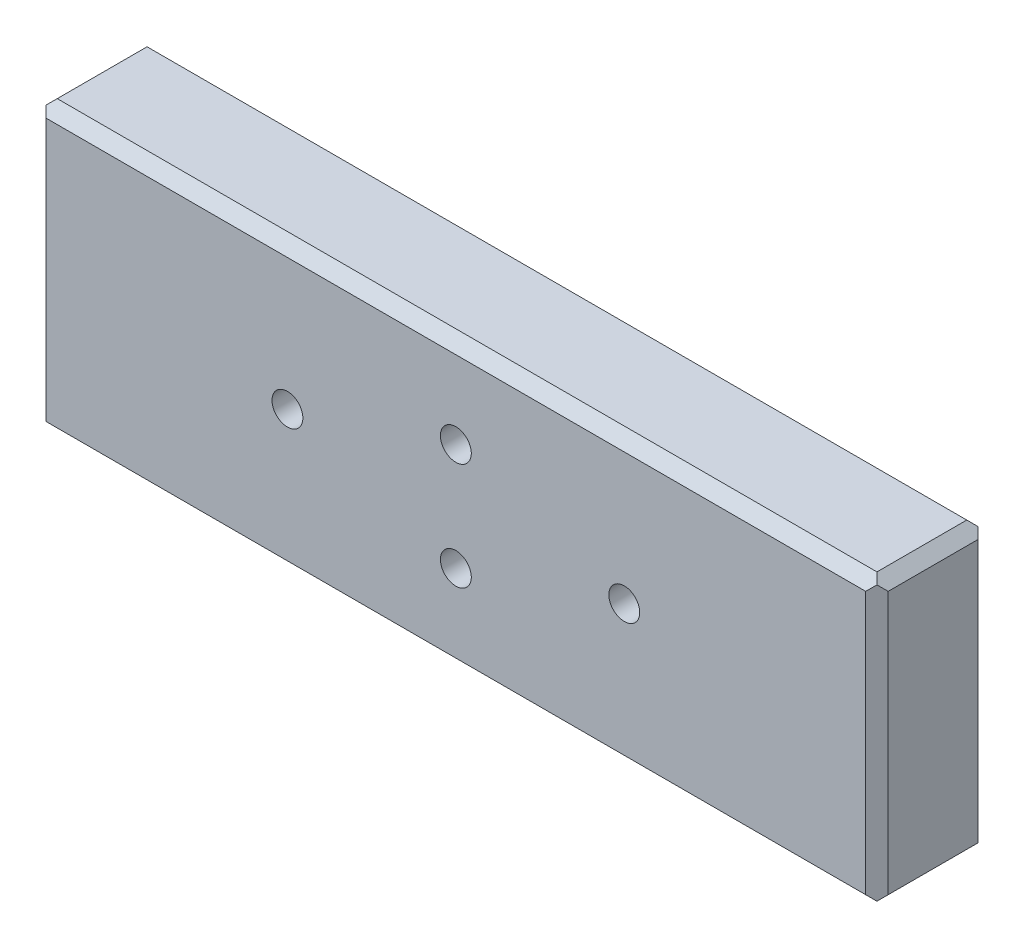
ISO-10303-21;
HEADER;
FILE_DESCRIPTION(('STEP AP214'),'2;1');
FILE_NAME('part.step','',(''),(''),'','','');
FILE_SCHEMA(('AUTOMOTIVE_DESIGN { 1 0 10303 214 1 1 1 1 }'));
ENDSEC;
DATA;
#1=APPLICATION_CONTEXT('core data for automotive mechanical design processes');
#2=APPLICATION_PROTOCOL_DEFINITION('international standard','automotive_design',2000,#1);
#3=PRODUCT_CONTEXT('',#1,'mechanical');
#4=PRODUCT('Part','Part','',(#3));
#5=PRODUCT_RELATED_PRODUCT_CATEGORY('part','',(#4));
#6=PRODUCT_DEFINITION_FORMATION('','',#4);
#7=PRODUCT_DEFINITION_CONTEXT('part definition',#1,'design');
#8=PRODUCT_DEFINITION('design','',#6,#7);
#9=PRODUCT_DEFINITION_SHAPE('','',#8);
#10=(LENGTH_UNIT() NAMED_UNIT(*) SI_UNIT(.MILLI.,.METRE.));
#11=(NAMED_UNIT(*) PLANE_ANGLE_UNIT() SI_UNIT($,.RADIAN.));
#12=(NAMED_UNIT(*) SI_UNIT($,.STERADIAN.) SOLID_ANGLE_UNIT());
#13=UNCERTAINTY_MEASURE_WITH_UNIT(LENGTH_MEASURE(1.E-05),#10,'distance_accuracy_value','');
#14=(GEOMETRIC_REPRESENTATION_CONTEXT(3) GLOBAL_UNCERTAINTY_ASSIGNED_CONTEXT((#13)) GLOBAL_UNIT_ASSIGNED_CONTEXT((#10,
#11,#12)) REPRESENTATION_CONTEXT('',''));
#15=CARTESIAN_POINT('',(0.,0.,0.));
#16=DIRECTION('',(0.,0.,1.));
#17=DIRECTION('',(1.,0.,0.));
#18=AXIS2_PLACEMENT_3D('',#15,#16,#17);
#19=CARTESIAN_POINT('',(0.,-9.55,20.));
#20=DIRECTION('',(0.,0.,-1.));
#21=DIRECTION('',(-1.,0.,0.));
#22=AXIS2_PLACEMENT_3D('',#19,#20,#21);
#23=CYLINDRICAL_SURFACE('',#22,2.75);
#24=CARTESIAN_POINT('',(0.,-9.55,20.));
#25=DIRECTION('',(0.,0.,-1.));
#26=DIRECTION('',(-1.,0.,0.));
#27=AXIS2_PLACEMENT_3D('',#24,#25,#26);
#28=CIRCLE('',#27,2.75);
#29=CARTESIAN_POINT('',(-2.75,-9.55,20.));
#30=VERTEX_POINT('',#29);
#31=EDGE_CURVE('E320',#30,#30,#28,.T.);
#32=ORIENTED_EDGE('',*,*,#31,.F.);
#33=EDGE_LOOP('',(#32));
#34=FACE_BOUND('',#33,.T.);
#35=CARTESIAN_POINT('',(0.,-9.55,5.));
#36=DIRECTION('',(0.,0.,-1.));
#37=DIRECTION('',(-1.,0.,0.));
#38=AXIS2_PLACEMENT_3D('',#35,#36,#37);
#39=CIRCLE('',#38,2.75);
#40=CARTESIAN_POINT('',(-2.75,-9.55,5.));
#41=VERTEX_POINT('',#40);
#42=EDGE_CURVE('E323',#41,#41,#39,.F.);
#43=ORIENTED_EDGE('',*,*,#42,.F.);
#44=EDGE_LOOP('',(#43));
#45=FACE_BOUND('',#44,.T.);
#46=ADVANCED_FACE('F32',(#34,#45),#23,.F.);
#47=CARTESIAN_POINT('',(0.,9.55,20.));
#48=DIRECTION('',(0.,0.,-1.));
#49=DIRECTION('',(-1.,0.,0.));
#50=AXIS2_PLACEMENT_3D('',#47,#48,#49);
#51=CYLINDRICAL_SURFACE('',#50,2.75);
#52=CARTESIAN_POINT('',(0.,9.55,20.));
#53=DIRECTION('',(0.,0.,-1.));
#54=DIRECTION('',(-1.,0.,0.));
#55=AXIS2_PLACEMENT_3D('',#52,#53,#54);
#56=CIRCLE('',#55,2.75);
#57=CARTESIAN_POINT('',(-2.75,9.55,20.));
#58=VERTEX_POINT('',#57);
#59=EDGE_CURVE('E317',#58,#58,#56,.T.);
#60=ORIENTED_EDGE('',*,*,#59,.F.);
#61=EDGE_LOOP('',(#60));
#62=FACE_BOUND('',#61,.T.);
#63=CARTESIAN_POINT('',(0.,9.55,5.));
#64=DIRECTION('',(0.,0.,-1.));
#65=DIRECTION('',(-1.,0.,0.));
#66=AXIS2_PLACEMENT_3D('',#63,#64,#65);
#67=CIRCLE('',#66,2.75);
#68=CARTESIAN_POINT('',(-2.75,9.55,5.));
#69=VERTEX_POINT('',#68);
#70=EDGE_CURVE('E581',#69,#69,#67,.F.);
#71=ORIENTED_EDGE('',*,*,#70,.F.);
#72=EDGE_LOOP('',(#71));
#73=FACE_BOUND('',#72,.T.);
#74=ADVANCED_FACE('F343',(#62,#73),#51,.F.);
#75=CARTESIAN_POINT('',(75.,25.4,20.));
#76=DIRECTION('',(-1.,0.,0.));
#77=DIRECTION('',(0.,0.,1.));
#78=AXIS2_PLACEMENT_3D('',#75,#76,#77);
#79=PLANE('',#78);
#80=DIRECTION('',(0.,1.,0.));
#81=VECTOR('',#80,1.);
#82=CARTESIAN_POINT('',(75.,25.4,2.));
#83=LINE('',#82,#81);
#84=CARTESIAN_POINT('',(75.,-23.4,2.));
#85=VERTEX_POINT('',#84);
#86=CARTESIAN_POINT('',(75.,23.4,2.));
#87=VERTEX_POINT('',#86);
#88=EDGE_CURVE('E178',#85,#87,#83,.T.);
#89=ORIENTED_EDGE('',*,*,#88,.T.);
#90=DIRECTION('',(0.,0.,1.));
#91=VECTOR('',#90,1.);
#92=CARTESIAN_POINT('',(75.,23.4,20.));
#93=LINE('',#92,#91);
#94=CARTESIAN_POINT('',(75.,23.4,18.));
#95=VERTEX_POINT('',#94);
#96=EDGE_CURVE('E240',#87,#95,#93,.T.);
#97=ORIENTED_EDGE('',*,*,#96,.T.);
#98=DIRECTION('',(0.,-1.,0.));
#99=VECTOR('',#98,1.);
#100=CARTESIAN_POINT('',(75.,-25.4,18.));
#101=LINE('',#100,#99);
#102=CARTESIAN_POINT('',(75.,-23.4,18.));
#103=VERTEX_POINT('',#102);
#104=EDGE_CURVE('E209',#95,#103,#101,.T.);
#105=ORIENTED_EDGE('',*,*,#104,.T.);
#106=DIRECTION('',(0.,0.,-1.));
#107=VECTOR('',#106,1.);
#108=CARTESIAN_POINT('',(75.,-23.4,20.));
#109=LINE('',#108,#107);
#110=EDGE_CURVE('E237',#103,#85,#109,.T.);
#111=ORIENTED_EDGE('',*,*,#110,.T.);
#112=EDGE_LOOP('',(#89,#97,#105,#111));
#113=FACE_BOUND('',#112,.T.);
#114=ADVANCED_FACE('F285',(#113),#79,.F.);
#115=CARTESIAN_POINT('',(-75.,25.4,20.));
#116=DIRECTION('',(0.,-1.,0.));
#117=DIRECTION('',(0.,0.,-1.));
#118=AXIS2_PLACEMENT_3D('',#115,#116,#117);
#119=PLANE('',#118);
#120=DIRECTION('',(1.,0.,0.));
#121=VECTOR('',#120,1.);
#122=CARTESIAN_POINT('',(75.,25.4,18.));
#123=LINE('',#122,#121);
#124=CARTESIAN_POINT('',(-73.,25.4,18.));
#125=VERTEX_POINT('',#124);
#126=CARTESIAN_POINT('',(73.,25.4,18.));
#127=VERTEX_POINT('',#126);
#128=EDGE_CURVE('E206',#125,#127,#123,.T.);
#129=ORIENTED_EDGE('',*,*,#128,.T.);
#130=DIRECTION('',(0.,0.,-1.));
#131=VECTOR('',#130,1.);
#132=CARTESIAN_POINT('',(73.,25.4,20.));
#133=LINE('',#132,#131);
#134=CARTESIAN_POINT('',(73.,25.4,2.));
#135=VERTEX_POINT('',#134);
#136=EDGE_CURVE('E226',#127,#135,#133,.T.);
#137=ORIENTED_EDGE('',*,*,#136,.T.);
#138=DIRECTION('',(-1.,0.,0.));
#139=VECTOR('',#138,1.);
#140=CARTESIAN_POINT('',(-75.,25.4,2.));
#141=LINE('',#140,#139);
#142=CARTESIAN_POINT('',(-73.,25.4,2.));
#143=VERTEX_POINT('',#142);
#144=EDGE_CURVE('E185',#135,#143,#141,.T.);
#145=ORIENTED_EDGE('',*,*,#144,.T.);
#146=DIRECTION('',(0.,0.,1.));
#147=VECTOR('',#146,1.);
#148=CARTESIAN_POINT('',(-73.,25.4,20.));
#149=LINE('',#148,#147);
#150=EDGE_CURVE('E215',#143,#125,#149,.T.);
#151=ORIENTED_EDGE('',*,*,#150,.T.);
#152=EDGE_LOOP('',(#129,#137,#145,#151));
#153=FACE_BOUND('',#152,.T.);
#154=ADVANCED_FACE('F302',(#153),#119,.F.);
#155=CARTESIAN_POINT('',(-75.,25.4,20.));
#156=DIRECTION('',(1.,0.,0.));
#157=DIRECTION('',(0.,0.,-1.));
#158=AXIS2_PLACEMENT_3D('',#155,#156,#157);
#159=PLANE('',#158);
#160=DIRECTION('',(0.,1.,0.));
#161=VECTOR('',#160,1.);
#162=CARTESIAN_POINT('',(-75.,25.4,18.));
#163=LINE('',#162,#161);
#164=CARTESIAN_POINT('',(-75.,-23.4,18.));
#165=VERTEX_POINT('',#164);
#166=CARTESIAN_POINT('',(-75.,23.4,18.));
#167=VERTEX_POINT('',#166);
#168=EDGE_CURVE('E203',#165,#167,#163,.T.);
#169=ORIENTED_EDGE('',*,*,#168,.T.);
#170=DIRECTION('',(0.,0.,-1.));
#171=VECTOR('',#170,1.);
#172=CARTESIAN_POINT('',(-75.,23.4,20.));
#173=LINE('',#172,#171);
#174=CARTESIAN_POINT('',(-75.,23.4,2.));
#175=VERTEX_POINT('',#174);
#176=EDGE_CURVE('E252',#167,#175,#173,.T.);
#177=ORIENTED_EDGE('',*,*,#176,.T.);
#178=DIRECTION('',(0.,-1.,0.));
#179=VECTOR('',#178,1.);
#180=CARTESIAN_POINT('',(-75.,25.4,2.));
#181=LINE('',#180,#179);
#182=CARTESIAN_POINT('',(-75.,-23.4,2.));
#183=VERTEX_POINT('',#182);
#184=EDGE_CURVE('E170',#175,#183,#181,.T.);
#185=ORIENTED_EDGE('',*,*,#184,.T.);
#186=DIRECTION('',(0.,0.,1.));
#187=VECTOR('',#186,1.);
#188=CARTESIAN_POINT('',(-75.,-23.4,20.));
#189=LINE('',#188,#187);
#190=EDGE_CURVE('E250',#183,#165,#189,.T.);
#191=ORIENTED_EDGE('',*,*,#190,.T.);
#192=EDGE_LOOP('',(#169,#177,#185,#191));
#193=FACE_BOUND('',#192,.T.);
#194=ADVANCED_FACE('F315',(#193),#159,.F.);
#195=CARTESIAN_POINT('',(-75.,-25.4,20.));
#196=DIRECTION('',(0.,1.,0.));
#197=DIRECTION('',(0.,0.,1.));
#198=AXIS2_PLACEMENT_3D('',#195,#196,#197);
#199=PLANE('',#198);
#200=DIRECTION('',(-1.,0.,0.));
#201=VECTOR('',#200,1.);
#202=CARTESIAN_POINT('',(-75.,-25.4,18.));
#203=LINE('',#202,#201);
#204=CARTESIAN_POINT('',(73.,-25.4,18.));
#205=VERTEX_POINT('',#204);
#206=CARTESIAN_POINT('',(-73.,-25.4,18.));
#207=VERTEX_POINT('',#206);
#208=EDGE_CURVE('E212',#205,#207,#203,.T.);
#209=ORIENTED_EDGE('',*,*,#208,.T.);
#210=DIRECTION('',(0.,0.,-1.));
#211=VECTOR('',#210,1.);
#212=CARTESIAN_POINT('',(-73.,-25.4,20.));
#213=LINE('',#212,#211);
#214=CARTESIAN_POINT('',(-73.,-25.4,2.));
#215=VERTEX_POINT('',#214);
#216=EDGE_CURVE('E264',#207,#215,#213,.T.);
#217=ORIENTED_EDGE('',*,*,#216,.T.);
#218=DIRECTION('',(1.,0.,0.));
#219=VECTOR('',#218,1.);
#220=CARTESIAN_POINT('',(-75.,-25.4,2.));
#221=LINE('',#220,#219);
#222=CARTESIAN_POINT('',(73.,-25.4,2.));
#223=VERTEX_POINT('',#222);
#224=EDGE_CURVE('E176',#215,#223,#221,.T.);
#225=ORIENTED_EDGE('',*,*,#224,.T.);
#226=DIRECTION('',(0.,0.,1.));
#227=VECTOR('',#226,1.);
#228=CARTESIAN_POINT('',(73.,-25.4,20.));
#229=LINE('',#228,#227);
#230=EDGE_CURVE('E262',#223,#205,#229,.T.);
#231=ORIENTED_EDGE('',*,*,#230,.T.);
#232=EDGE_LOOP('',(#209,#217,#225,#231));
#233=FACE_BOUND('',#232,.T.);
#234=ADVANCED_FACE('F330',(#233),#199,.F.);
#235=CARTESIAN_POINT('',(0.,0.,20.));
#236=DIRECTION('',(0.,0.,1.));
#237=DIRECTION('',(1.,0.,0.));
#238=AXIS2_PLACEMENT_3D('',#235,#236,#237);
#239=PLANE('',#238);
#240=DIRECTION('',(-1.,0.,0.));
#241=VECTOR('',#240,1.);
#242=CARTESIAN_POINT('',(-75.,23.4,20.));
#243=LINE('',#242,#241);
#244=CARTESIAN_POINT('',(73.,23.4,20.));
#245=VERTEX_POINT('',#244);
#246=CARTESIAN_POINT('',(-73.,23.4,20.));
#247=VERTEX_POINT('',#246);
#248=EDGE_CURVE('E198',#245,#247,#243,.T.);
#249=ORIENTED_EDGE('',*,*,#248,.T.);
#250=DIRECTION('',(0.,-1.,0.));
#251=VECTOR('',#250,1.);
#252=CARTESIAN_POINT('',(-73.,-25.4,20.));
#253=LINE('',#252,#251);
#254=CARTESIAN_POINT('',(-73.,-23.4,20.));
#255=VERTEX_POINT('',#254);
#256=EDGE_CURVE('E200',#247,#255,#253,.T.);
#257=ORIENTED_EDGE('',*,*,#256,.T.);
#258=DIRECTION('',(1.,0.,0.));
#259=VECTOR('',#258,1.);
#260=CARTESIAN_POINT('',(75.,-23.4,20.));
#261=LINE('',#260,#259);
#262=CARTESIAN_POINT('',(73.,-23.4,20.));
#263=VERTEX_POINT('',#262);
#264=EDGE_CURVE('E188',#255,#263,#261,.T.);
#265=ORIENTED_EDGE('',*,*,#264,.T.);
#266=DIRECTION('',(0.,1.,0.));
#267=VECTOR('',#266,1.);
#268=CARTESIAN_POINT('',(73.,25.4,20.));
#269=LINE('',#268,#267);
#270=EDGE_CURVE('E196',#263,#245,#269,.T.);
#271=ORIENTED_EDGE('',*,*,#270,.T.);
#272=EDGE_LOOP('',(#249,#257,#265,#271));
#273=FACE_BOUND('',#272,.T.);
#274=ORIENTED_EDGE('',*,*,#59,.T.);
#275=EDGE_LOOP('',(#274));
#276=FACE_BOUND('',#275,.T.);
#277=ORIENTED_EDGE('',*,*,#31,.T.);
#278=EDGE_LOOP('',(#277));
#279=FACE_BOUND('',#278,.T.);
#280=CARTESIAN_POINT('',(-30.,0.,20.));
#281=DIRECTION('',(0.,0.,-1.));
#282=DIRECTION('',(-1.,0.,0.));
#283=AXIS2_PLACEMENT_3D('',#280,#281,#282);
#284=CIRCLE('',#283,2.75);
#285=CARTESIAN_POINT('',(-32.75,0.,20.));
#286=VERTEX_POINT('',#285);
#287=EDGE_CURVE('E570',#286,#286,#284,.T.);
#288=ORIENTED_EDGE('',*,*,#287,.T.);
#289=EDGE_LOOP('',(#288));
#290=FACE_BOUND('',#289,.T.);
#291=CARTESIAN_POINT('',(30.,0.,20.));
#292=DIRECTION('',(0.,0.,-1.));
#293=DIRECTION('',(-1.,0.,0.));
#294=AXIS2_PLACEMENT_3D('',#291,#292,#293);
#295=CIRCLE('',#294,2.75);
#296=CARTESIAN_POINT('',(27.25,0.,20.));
#297=VERTEX_POINT('',#296);
#298=EDGE_CURVE('E576',#297,#297,#295,.T.);
#299=ORIENTED_EDGE('',*,*,#298,.T.);
#300=EDGE_LOOP('',(#299));
#301=FACE_BOUND('',#300,.T.);
#302=ADVANCED_FACE('F332',(#273,#276,#279,#290,#301),#239,.T.);
#303=CARTESIAN_POINT('',(0.,0.,0.));
#304=DIRECTION('',(0.,0.,1.));
#305=DIRECTION('',(1.,0.,0.));
#306=AXIS2_PLACEMENT_3D('',#303,#304,#305);
#307=PLANE('',#306);
#308=DIRECTION('',(-1.,0.,0.));
#309=VECTOR('',#308,1.);
#310=CARTESIAN_POINT('',(0.,-23.4,0.));
#311=LINE('',#310,#309);
#312=CARTESIAN_POINT('',(73.,-23.4,0.));
#313=VERTEX_POINT('',#312);
#314=CARTESIAN_POINT('',(-73.,-23.4,0.));
#315=VERTEX_POINT('',#314);
#316=EDGE_CURVE('E175',#313,#315,#311,.T.);
#317=ORIENTED_EDGE('',*,*,#316,.T.);
#318=DIRECTION('',(0.,1.,0.));
#319=VECTOR('',#318,1.);
#320=CARTESIAN_POINT('',(-73.,0.,0.));
#321=LINE('',#320,#319);
#322=CARTESIAN_POINT('',(-73.,23.4,0.));
#323=VERTEX_POINT('',#322);
#324=EDGE_CURVE('E153',#315,#323,#321,.T.);
#325=ORIENTED_EDGE('',*,*,#324,.T.);
#326=DIRECTION('',(1.,0.,0.));
#327=VECTOR('',#326,1.);
#328=CARTESIAN_POINT('',(0.,23.4,0.));
#329=LINE('',#328,#327);
#330=CARTESIAN_POINT('',(73.,23.4,0.));
#331=VERTEX_POINT('',#330);
#332=EDGE_CURVE('E162',#323,#331,#329,.T.);
#333=ORIENTED_EDGE('',*,*,#332,.T.);
#334=DIRECTION('',(0.,-1.,0.));
#335=VECTOR('',#334,1.);
#336=CARTESIAN_POINT('',(73.,0.,0.));
#337=LINE('',#336,#335);
#338=EDGE_CURVE('E169',#331,#313,#337,.T.);
#339=ORIENTED_EDGE('',*,*,#338,.T.);
#340=EDGE_LOOP('',(#317,#325,#333,#339));
#341=FACE_BOUND('',#340,.T.);
#342=CARTESIAN_POINT('',(0.,9.55,0.));
#343=DIRECTION('',(0.,0.,-1.));
#344=DIRECTION('',(-1.,0.,0.));
#345=AXIS2_PLACEMENT_3D('',#342,#343,#344);
#346=CIRCLE('',#345,5.);
#347=CARTESIAN_POINT('',(-5.,9.55,0.));
#348=VERTEX_POINT('',#347);
#349=EDGE_CURVE('E564',#348,#348,#346,.T.);
#350=ORIENTED_EDGE('',*,*,#349,.F.);
#351=EDGE_LOOP('',(#350));
#352=FACE_BOUND('',#351,.T.);
#353=CARTESIAN_POINT('',(0.,-9.55,0.));
#354=DIRECTION('',(0.,0.,-1.));
#355=DIRECTION('',(-1.,0.,0.));
#356=AXIS2_PLACEMENT_3D('',#353,#354,#355);
#357=CIRCLE('',#356,5.);
#358=CARTESIAN_POINT('',(-5.00000000000001,-9.55,0.));
#359=VERTEX_POINT('',#358);
#360=EDGE_CURVE('E193',#359,#359,#357,.T.);
#361=ORIENTED_EDGE('',*,*,#360,.F.);
#362=EDGE_LOOP('',(#361));
#363=FACE_BOUND('',#362,.T.);
#364=CARTESIAN_POINT('',(-30.,0.,0.));
#365=DIRECTION('',(0.,0.,-1.));
#366=DIRECTION('',(-1.,0.,0.));
#367=AXIS2_PLACEMENT_3D('',#364,#365,#366);
#368=CIRCLE('',#367,2.75);
#369=CARTESIAN_POINT('',(-32.75,0.,0.));
#370=VERTEX_POINT('',#369);
#371=EDGE_CURVE('E573',#370,#370,#368,.T.);
#372=ORIENTED_EDGE('',*,*,#371,.F.);
#373=EDGE_LOOP('',(#372));
#374=FACE_BOUND('',#373,.T.);
#375=CARTESIAN_POINT('',(30.,0.,0.));
#376=DIRECTION('',(0.,0.,-1.));
#377=DIRECTION('',(-1.,0.,0.));
#378=AXIS2_PLACEMENT_3D('',#375,#376,#377);
#379=CIRCLE('',#378,2.75);
#380=CARTESIAN_POINT('',(27.25,0.,0.));
#381=VERTEX_POINT('',#380);
#382=EDGE_CURVE('E579',#381,#381,#379,.T.);
#383=ORIENTED_EDGE('',*,*,#382,.F.);
#384=EDGE_LOOP('',(#383));
#385=FACE_BOUND('',#384,.T.);
#386=ADVANCED_FACE('F172',(#341,#352,#363,#374,#385),#307,.F.);
#387=CARTESIAN_POINT('',(30.,0.,20.));
#388=DIRECTION('',(0.,0.,-1.));
#389=DIRECTION('',(-1.,0.,0.));
#390=AXIS2_PLACEMENT_3D('',#387,#388,#389);
#391=CYLINDRICAL_SURFACE('',#390,2.75);
#392=ORIENTED_EDGE('',*,*,#298,.F.);
#393=EDGE_LOOP('',(#392));
#394=FACE_BOUND('',#393,.T.);
#395=ORIENTED_EDGE('',*,*,#382,.T.);
#396=EDGE_LOOP('',(#395));
#397=FACE_BOUND('',#396,.T.);
#398=ADVANCED_FACE('F359',(#394,#397),#391,.F.);
#399=CARTESIAN_POINT('',(-30.,0.,20.));
#400=DIRECTION('',(0.,0.,-1.));
#401=DIRECTION('',(-1.,0.,0.));
#402=AXIS2_PLACEMENT_3D('',#399,#400,#401);
#403=CYLINDRICAL_SURFACE('',#402,2.75);
#404=ORIENTED_EDGE('',*,*,#287,.F.);
#405=EDGE_LOOP('',(#404));
#406=FACE_BOUND('',#405,.T.);
#407=ORIENTED_EDGE('',*,*,#371,.T.);
#408=EDGE_LOOP('',(#407));
#409=FACE_BOUND('',#408,.T.);
#410=ADVANCED_FACE('F355',(#406,#409),#403,.F.);
#411=CARTESIAN_POINT('',(0.,9.55,5.));
#412=DIRECTION('',(0.,0.,-1.));
#413=DIRECTION('',(-1.,0.,0.));
#414=AXIS2_PLACEMENT_3D('',#411,#412,#413);
#415=PLANE('',#414);
#416=CARTESIAN_POINT('',(0.,9.55,5.));
#417=DIRECTION('',(0.,0.,-1.));
#418=DIRECTION('',(-1.,0.,0.));
#419=AXIS2_PLACEMENT_3D('',#416,#417,#418);
#420=CIRCLE('',#419,5.);
#421=CARTESIAN_POINT('',(-5.,9.55,5.));
#422=VERTEX_POINT('',#421);
#423=EDGE_CURVE('E583',#422,#422,#420,.T.);
#424=ORIENTED_EDGE('',*,*,#423,.T.);
#425=EDGE_LOOP('',(#424));
#426=FACE_BOUND('',#425,.T.);
#427=ORIENTED_EDGE('',*,*,#70,.T.);
#428=EDGE_LOOP('',(#427));
#429=FACE_BOUND('',#428,.T.);
#430=ADVANCED_FACE('F358',(#426,#429),#415,.T.);
#431=CARTESIAN_POINT('',(0.,9.55,5.));
#432=DIRECTION('',(0.,0.,-1.));
#433=DIRECTION('',(-1.,0.,0.));
#434=AXIS2_PLACEMENT_3D('',#431,#432,#433);
#435=CYLINDRICAL_SURFACE('',#434,5.);
#436=ORIENTED_EDGE('',*,*,#423,.F.);
#437=EDGE_LOOP('',(#436));
#438=FACE_BOUND('',#437,.T.);
#439=ORIENTED_EDGE('',*,*,#349,.T.);
#440=EDGE_LOOP('',(#439));
#441=FACE_BOUND('',#440,.T.);
#442=ADVANCED_FACE('F383',(#438,#441),#435,.F.);
#443=CARTESIAN_POINT('',(0.,-9.55,5.));
#444=DIRECTION('',(0.,0.,-1.));
#445=DIRECTION('',(-1.,0.,0.));
#446=AXIS2_PLACEMENT_3D('',#443,#444,#445);
#447=PLANE('',#446);
#448=CARTESIAN_POINT('',(0.,-9.55,5.));
#449=DIRECTION('',(0.,0.,-1.));
#450=DIRECTION('',(-1.,0.,0.));
#451=AXIS2_PLACEMENT_3D('',#448,#449,#450);
#452=CIRCLE('',#451,5.);
#453=CARTESIAN_POINT('',(-5.00000000000001,-9.55,5.));
#454=VERTEX_POINT('',#453);
#455=EDGE_CURVE('E559',#454,#454,#452,.T.);
#456=ORIENTED_EDGE('',*,*,#455,.T.);
#457=EDGE_LOOP('',(#456));
#458=FACE_BOUND('',#457,.T.);
#459=ORIENTED_EDGE('',*,*,#42,.T.);
#460=EDGE_LOOP('',(#459));
#461=FACE_BOUND('',#460,.T.);
#462=ADVANCED_FACE('F392',(#458,#461),#447,.T.);
#463=CARTESIAN_POINT('',(0.,-9.55,5.));
#464=DIRECTION('',(0.,0.,-1.));
#465=DIRECTION('',(-1.,0.,0.));
#466=AXIS2_PLACEMENT_3D('',#463,#464,#465);
#467=CYLINDRICAL_SURFACE('',#466,5.);
#468=ORIENTED_EDGE('',*,*,#455,.F.);
#469=EDGE_LOOP('',(#468));
#470=FACE_BOUND('',#469,.T.);
#471=ORIENTED_EDGE('',*,*,#360,.T.);
#472=EDGE_LOOP('',(#471));
#473=FACE_BOUND('',#472,.T.);
#474=ADVANCED_FACE('F400',(#470,#473),#467,.F.);
#475=CARTESIAN_POINT('',(75.,25.4,2.));
#476=DIRECTION('',(-0.707106781186545,0.,0.70710678118655));
#477=DIRECTION('',(0.,1.,0.));
#478=AXIS2_PLACEMENT_3D('',#475,#476,#477);
#479=PLANE('',#478);
#480=DIRECTION('',(-0.577350269189627,-0.577350269189627,-0.577350269189623));
#481=VECTOR('',#480,1.);
#482=CARTESIAN_POINT('',(24.9999999999998,-24.6000000000002,-47.9999999999999));
#483=LINE('',#482,#481);
#484=CARTESIAN_POINT('',(74.,24.4,1.00000000000001));
#485=VERTEX_POINT('',#484);
#486=EDGE_CURVE('E166',#485,#331,#483,.T.);
#487=ORIENTED_EDGE('',*,*,#486,.F.);
#488=DIRECTION('',(0.577350269189623,-0.577350269189635,0.577350269189619));
#489=VECTOR('',#488,1.);
#490=CARTESIAN_POINT('',(74.3333333333333,24.0666666666667,1.33333333333333));
#491=LINE('',#490,#489);
#492=EDGE_CURVE('E235',#485,#87,#491,.T.);
#493=ORIENTED_EDGE('',*,*,#492,.T.);
#494=ORIENTED_EDGE('',*,*,#88,.F.);
#495=DIRECTION('',(-0.577350269189627,-0.577350269189627,-0.577350269189623));
#496=VECTOR('',#495,1.);
#497=CARTESIAN_POINT('',(91.2666666666668,-7.13333333333324,18.2666666666666));
#498=LINE('',#497,#496);
#499=CARTESIAN_POINT('',(74.,-24.4,0.999999999999997));
#500=VERTEX_POINT('',#499);
#501=EDGE_CURVE('E233',#85,#500,#498,.T.);
#502=ORIENTED_EDGE('',*,*,#501,.T.);
#503=DIRECTION('',(-0.577350269189627,0.577350269189627,-0.577350269189623));
#504=VECTOR('',#503,1.);
#505=CARTESIAN_POINT('',(58.0666666666666,-8.46666666666658,-14.9333333333333));
#506=LINE('',#505,#504);
#507=EDGE_CURVE('E158',#313,#500,#506,.F.);
#508=ORIENTED_EDGE('',*,*,#507,.F.);
#509=ORIENTED_EDGE('',*,*,#338,.F.);
#510=EDGE_LOOP('',(#487,#493,#494,#502,#508,#509));
#511=FACE_BOUND('',#510,.T.);
#512=ADVANCED_FACE('F288',(#511),#479,.F.);
#513=CARTESIAN_POINT('',(-75.,25.4,2.));
#514=DIRECTION('',(0.,-0.707106781186545,0.70710678118655));
#515=DIRECTION('',(-1.,0.,0.));
#516=AXIS2_PLACEMENT_3D('',#513,#514,#515);
#517=PLANE('',#516);
#518=ORIENTED_EDGE('',*,*,#144,.F.);
#519=DIRECTION('',(0.577350269189619,-0.577350269189631,-0.577350269189627));
#520=VECTOR('',#519,1.);
#521=CARTESIAN_POINT('',(23.6666666666678,74.7333333333332,51.3333333333329));
#522=LINE('',#521,#520);
#523=EDGE_CURVE('E231',#135,#485,#522,.T.);
#524=ORIENTED_EDGE('',*,*,#523,.T.);
#525=ORIENTED_EDGE('',*,*,#486,.T.);
#526=ORIENTED_EDGE('',*,*,#332,.F.);
#527=DIRECTION('',(-0.577350269189627,0.577350269189627,0.577350269189623));
#528=VECTOR('',#527,1.);
#529=CARTESIAN_POINT('',(-75.,25.4,2.));
#530=LINE('',#529,#528);
#531=CARTESIAN_POINT('',(-74.,24.4,0.999999999999994));
#532=VERTEX_POINT('',#531);
#533=EDGE_CURVE('E147',#532,#323,#530,.F.);
#534=ORIENTED_EDGE('',*,*,#533,.F.);
#535=DIRECTION('',(0.577350269189627,0.577350269189627,0.577350269189623));
#536=VECTOR('',#535,1.);
#537=CARTESIAN_POINT('',(-73.6666666666666,24.7333333333333,1.33333333333333));
#538=LINE('',#537,#536);
#539=EDGE_CURVE('E229',#532,#143,#538,.T.);
#540=ORIENTED_EDGE('',*,*,#539,.T.);
#541=EDGE_LOOP('',(#518,#524,#525,#526,#534,#540));
#542=FACE_BOUND('',#541,.T.);
#543=ADVANCED_FACE('F164',(#542),#517,.F.);
#544=CARTESIAN_POINT('',(-75.,-25.4,2.));
#545=DIRECTION('',(0.,0.707106781186545,0.70710678118655));
#546=DIRECTION('',(1.,0.,0.));
#547=AXIS2_PLACEMENT_3D('',#544,#545,#546);
#548=PLANE('',#547);
#549=ORIENTED_EDGE('',*,*,#224,.F.);
#550=DIRECTION('',(-0.577350269189625,0.577350269189629,-0.577350269189625));
#551=VECTOR('',#550,1.);
#552=CARTESIAN_POINT('',(-73.6666666666666,-24.7333333333333,1.33333333333333));
#553=LINE('',#552,#551);
#554=CARTESIAN_POINT('',(-74.,-24.4,0.999999999999992));
#555=VERTEX_POINT('',#554);
#556=EDGE_CURVE('E55',#215,#555,#553,.T.);
#557=ORIENTED_EDGE('',*,*,#556,.T.);
#558=DIRECTION('',(0.577350269189627,0.577350269189627,-0.577350269189623));
#559=VECTOR('',#558,1.);
#560=CARTESIAN_POINT('',(-75.,-25.4,2.));
#561=LINE('',#560,#559);
#562=EDGE_CURVE('E159',#315,#555,#561,.F.);
#563=ORIENTED_EDGE('',*,*,#562,.F.);
#564=ORIENTED_EDGE('',*,*,#316,.F.);
#565=ORIENTED_EDGE('',*,*,#507,.T.);
#566=DIRECTION('',(-0.577350269189627,-0.577350269189627,0.577350269189623));
#567=VECTOR('',#566,1.);
#568=CARTESIAN_POINT('',(23.6666666666664,-74.7333333333335,51.3333333333332));
#569=LINE('',#568,#567);
#570=EDGE_CURVE('E47',#500,#223,#569,.T.);
#571=ORIENTED_EDGE('',*,*,#570,.T.);
#572=EDGE_LOOP('',(#549,#557,#563,#564,#565,#571));
#573=FACE_BOUND('',#572,.T.);
#574=ADVANCED_FACE('F325',(#573),#548,.F.);
#575=CARTESIAN_POINT('',(-75.,25.4,2.));
#576=DIRECTION('',(0.707106781186545,0.,0.70710678118655));
#577=DIRECTION('',(0.,-1.,0.));
#578=AXIS2_PLACEMENT_3D('',#575,#576,#577);
#579=PLANE('',#578);
#580=ORIENTED_EDGE('',*,*,#184,.F.);
#581=DIRECTION('',(0.577350269189627,0.577350269189627,-0.577350269189623));
#582=VECTOR('',#581,1.);
#583=CARTESIAN_POINT('',(-74.3333333333333,24.0666666666666,1.33333333333333));
#584=LINE('',#583,#582);
#585=EDGE_CURVE('E155',#175,#532,#584,.T.);
#586=ORIENTED_EDGE('',*,*,#585,.T.);
#587=ORIENTED_EDGE('',*,*,#533,.T.);
#588=ORIENTED_EDGE('',*,*,#324,.F.);
#589=ORIENTED_EDGE('',*,*,#562,.T.);
#590=DIRECTION('',(-0.577350269189626,0.57735026918963,0.577350269189622));
#591=VECTOR('',#590,1.);
#592=CARTESIAN_POINT('',(-91.2666666666668,-7.13333333333308,18.2666666666667));
#593=LINE('',#592,#591);
#594=EDGE_CURVE('E255',#555,#183,#593,.T.);
#595=ORIENTED_EDGE('',*,*,#594,.T.);
#596=EDGE_LOOP('',(#580,#586,#587,#588,#589,#595));
#597=FACE_BOUND('',#596,.T.);
#598=ADVANCED_FACE('F150',(#597),#579,.F.);
#599=CARTESIAN_POINT('',(73.,0.,20.));
#600=DIRECTION('',(0.707106781186547,0.,0.707106781186547));
#601=DIRECTION('',(0.,-1.,0.));
#602=AXIS2_PLACEMENT_3D('',#599,#600,#601);
#603=PLANE('',#602);
#604=ORIENTED_EDGE('',*,*,#104,.F.);
#605=DIRECTION('',(0.577350269189622,-0.577350269189634,-0.577350269189622));
#606=VECTOR('',#605,1.);
#607=CARTESIAN_POINT('',(81.4666666666667,16.9333333333331,11.5333333333333));
#608=LINE('',#607,#606);
#609=CARTESIAN_POINT('',(74.,24.4,19.));
#610=VERTEX_POINT('',#609);
#611=EDGE_CURVE('E244',#95,#610,#608,.F.);
#612=ORIENTED_EDGE('',*,*,#611,.T.);
#613=DIRECTION('',(-0.577350269189626,-0.577350269189626,0.577350269189626));
#614=VECTOR('',#613,1.);
#615=CARTESIAN_POINT('',(65.2,15.6,27.8));
#616=LINE('',#615,#614);
#617=EDGE_CURVE('E189',#245,#610,#616,.F.);
#618=ORIENTED_EDGE('',*,*,#617,.F.);
#619=ORIENTED_EDGE('',*,*,#270,.F.);
#620=DIRECTION('',(-0.577350269189626,0.577350269189626,0.577350269189626));
#621=VECTOR('',#620,1.);
#622=CARTESIAN_POINT('',(48.6666666666667,0.933333333333359,44.3333333333333));
#623=LINE('',#622,#621);
#624=CARTESIAN_POINT('',(74.,-24.4,19.));
#625=VERTEX_POINT('',#624);
#626=EDGE_CURVE('E221',#625,#263,#623,.T.);
#627=ORIENTED_EDGE('',*,*,#626,.F.);
#628=DIRECTION('',(-0.577350269189626,-0.577350269189626,0.577350269189626));
#629=VECTOR('',#628,1.);
#630=CARTESIAN_POINT('',(81.4666666666666,-16.9333333333333,11.5333333333333));
#631=LINE('',#630,#629);
#632=EDGE_CURVE('E242',#625,#103,#631,.F.);
#633=ORIENTED_EDGE('',*,*,#632,.T.);
#634=EDGE_LOOP('',(#604,#612,#618,#619,#627,#633));
#635=FACE_BOUND('',#634,.T.);
#636=ADVANCED_FACE('F280',(#635),#603,.T.);
#637=CARTESIAN_POINT('',(0.,23.4,20.));
#638=DIRECTION('',(0.,0.707106781186547,0.707106781186547));
#639=DIRECTION('',(1.,0.,0.));
#640=AXIS2_PLACEMENT_3D('',#637,#638,#639);
#641=PLANE('',#640);
#642=ORIENTED_EDGE('',*,*,#617,.T.);
#643=DIRECTION('',(0.577350269189618,-0.57735026918963,0.57735026918963));
#644=VECTOR('',#643,1.);
#645=CARTESIAN_POINT('',(50.0000000000007,48.3999999999998,-4.99999999999983));
#646=LINE('',#645,#644);
#647=EDGE_CURVE('E248',#610,#127,#646,.F.);
#648=ORIENTED_EDGE('',*,*,#647,.T.);
#649=ORIENTED_EDGE('',*,*,#128,.F.);
#650=DIRECTION('',(0.577350269189626,0.577350269189626,-0.577350269189626));
#651=VECTOR('',#650,1.);
#652=CARTESIAN_POINT('',(-50.,48.4,-5.));
#653=LINE('',#652,#651);
#654=CARTESIAN_POINT('',(-74.,24.4,19.));
#655=VERTEX_POINT('',#654);
#656=EDGE_CURVE('E246',#125,#655,#653,.F.);
#657=ORIENTED_EDGE('',*,*,#656,.T.);
#658=DIRECTION('',(0.577350269189626,-0.577350269189626,0.577350269189626));
#659=VECTOR('',#658,1.);
#660=CARTESIAN_POINT('',(-48.6666666666666,-0.933333333333352,44.3333333333333));
#661=LINE('',#660,#659);
#662=EDGE_CURVE('E218',#247,#655,#661,.F.);
#663=ORIENTED_EDGE('',*,*,#662,.F.);
#664=ORIENTED_EDGE('',*,*,#248,.F.);
#665=EDGE_LOOP('',(#642,#648,#649,#657,#663,#664));
#666=FACE_BOUND('',#665,.T.);
#667=ADVANCED_FACE('F298',(#666),#641,.T.);
#668=CARTESIAN_POINT('',(0.,-23.4,20.));
#669=DIRECTION('',(0.,-0.707106781186547,0.707106781186547));
#670=DIRECTION('',(-1.,0.,0.));
#671=AXIS2_PLACEMENT_3D('',#668,#669,#670);
#672=PLANE('',#671);
#673=DIRECTION('',(-0.577350269189626,-0.577350269189626,-0.577350269189626));
#674=VECTOR('',#673,1.);
#675=CARTESIAN_POINT('',(-48.6666666666666,0.933333333333352,44.3333333333333));
#676=LINE('',#675,#674);
#677=CARTESIAN_POINT('',(-74.,-24.4,19.));
#678=VERTEX_POINT('',#677);
#679=EDGE_CURVE('E216',#678,#255,#676,.F.);
#680=ORIENTED_EDGE('',*,*,#679,.F.);
#681=DIRECTION('',(-0.577350269189623,0.577350269189627,0.577350269189627));
#682=VECTOR('',#681,1.);
#683=CARTESIAN_POINT('',(-50.0000000000002,-48.3999999999999,-4.99999999999993));
#684=LINE('',#683,#682);
#685=EDGE_CURVE('E11',#678,#207,#684,.F.);
#686=ORIENTED_EDGE('',*,*,#685,.T.);
#687=ORIENTED_EDGE('',*,*,#208,.F.);
#688=DIRECTION('',(-0.577350269189626,-0.577350269189626,-0.577350269189626));
#689=VECTOR('',#688,1.);
#690=CARTESIAN_POINT('',(50.,-48.4,-5.00000000000001));
#691=LINE('',#690,#689);
#692=EDGE_CURVE('E40',#205,#625,#691,.F.);
#693=ORIENTED_EDGE('',*,*,#692,.T.);
#694=ORIENTED_EDGE('',*,*,#626,.T.);
#695=ORIENTED_EDGE('',*,*,#264,.F.);
#696=EDGE_LOOP('',(#680,#686,#687,#693,#694,#695));
#697=FACE_BOUND('',#696,.T.);
#698=ADVANCED_FACE('F272',(#697),#672,.T.);
#699=CARTESIAN_POINT('',(-73.,0.,20.));
#700=DIRECTION('',(-0.707106781186547,0.,0.707106781186547));
#701=DIRECTION('',(0.,1.,0.));
#702=AXIS2_PLACEMENT_3D('',#699,#700,#701);
#703=PLANE('',#702);
#704=ORIENTED_EDGE('',*,*,#662,.T.);
#705=DIRECTION('',(0.577350269189626,0.577350269189626,0.577350269189626));
#706=VECTOR('',#705,1.);
#707=CARTESIAN_POINT('',(-81.4666666666666,16.9333333333333,11.5333333333333));
#708=LINE('',#707,#706);
#709=EDGE_CURVE('E260',#655,#167,#708,.F.);
#710=ORIENTED_EDGE('',*,*,#709,.T.);
#711=ORIENTED_EDGE('',*,*,#168,.F.);
#712=DIRECTION('',(-0.577350269189624,0.577350269189628,-0.577350269189624));
#713=VECTOR('',#712,1.);
#714=CARTESIAN_POINT('',(-81.4666666666666,-16.9333333333333,11.5333333333333));
#715=LINE('',#714,#713);
#716=EDGE_CURVE('E258',#165,#678,#715,.F.);
#717=ORIENTED_EDGE('',*,*,#716,.T.);
#718=ORIENTED_EDGE('',*,*,#679,.T.);
#719=ORIENTED_EDGE('',*,*,#256,.F.);
#720=EDGE_LOOP('',(#704,#710,#711,#717,#718,#719));
#721=FACE_BOUND('',#720,.T.);
#722=ADVANCED_FACE('F311',(#721),#703,.T.);
#723=CARTESIAN_POINT('',(73.,25.4,20.));
#724=DIRECTION('',(-0.707106781186555,-0.70710678118654,0.));
#725=DIRECTION('',(0.,0.,-1.));
#726=AXIS2_PLACEMENT_3D('',#723,#724,#725);
#727=PLANE('',#726);
#728=ORIENTED_EDGE('',*,*,#611,.F.);
#729=ORIENTED_EDGE('',*,*,#96,.F.);
#730=ORIENTED_EDGE('',*,*,#492,.F.);
#731=ORIENTED_EDGE('',*,*,#523,.F.);
#732=ORIENTED_EDGE('',*,*,#136,.F.);
#733=ORIENTED_EDGE('',*,*,#647,.F.);
#734=EDGE_LOOP('',(#728,#729,#730,#731,#732,#733));
#735=FACE_BOUND('',#734,.T.);
#736=ADVANCED_FACE('F293',(#735),#727,.F.);
#737=CARTESIAN_POINT('',(-75.,23.4,20.));
#738=DIRECTION('',(0.707106781186547,-0.707106781186547,0.));
#739=DIRECTION('',(0.,0.,-1.));
#740=AXIS2_PLACEMENT_3D('',#737,#738,#739);
#741=PLANE('',#740);
#742=ORIENTED_EDGE('',*,*,#656,.F.);
#743=ORIENTED_EDGE('',*,*,#150,.F.);
#744=ORIENTED_EDGE('',*,*,#539,.F.);
#745=ORIENTED_EDGE('',*,*,#585,.F.);
#746=ORIENTED_EDGE('',*,*,#176,.F.);
#747=ORIENTED_EDGE('',*,*,#709,.F.);
#748=EDGE_LOOP('',(#742,#743,#744,#745,#746,#747));
#749=FACE_BOUND('',#748,.T.);
#750=ADVANCED_FACE('F306',(#749),#741,.F.);
#751=CARTESIAN_POINT('',(-73.,-25.4,20.));
#752=DIRECTION('',(0.70710678118655,0.707106781186545,0.));
#753=DIRECTION('',(0.,0.,-1.));
#754=AXIS2_PLACEMENT_3D('',#751,#752,#753);
#755=PLANE('',#754);
#756=ORIENTED_EDGE('',*,*,#716,.F.);
#757=ORIENTED_EDGE('',*,*,#190,.F.);
#758=ORIENTED_EDGE('',*,*,#594,.F.);
#759=ORIENTED_EDGE('',*,*,#556,.F.);
#760=ORIENTED_EDGE('',*,*,#216,.F.);
#761=ORIENTED_EDGE('',*,*,#685,.F.);
#762=EDGE_LOOP('',(#756,#757,#758,#759,#760,#761));
#763=FACE_BOUND('',#762,.T.);
#764=ADVANCED_FACE('F327',(#763),#755,.F.);
#765=CARTESIAN_POINT('',(75.,-23.4,20.));
#766=DIRECTION('',(-0.707106781186547,0.707106781186547,0.));
#767=DIRECTION('',(0.,0.,-1.));
#768=AXIS2_PLACEMENT_3D('',#765,#766,#767);
#769=PLANE('',#768);
#770=ORIENTED_EDGE('',*,*,#692,.F.);
#771=ORIENTED_EDGE('',*,*,#230,.F.);
#772=ORIENTED_EDGE('',*,*,#570,.F.);
#773=ORIENTED_EDGE('',*,*,#501,.F.);
#774=ORIENTED_EDGE('',*,*,#110,.F.);
#775=ORIENTED_EDGE('',*,*,#632,.F.);
#776=EDGE_LOOP('',(#770,#771,#772,#773,#774,#775));
#777=FACE_BOUND('',#776,.T.);
#778=ADVANCED_FACE('F34',(#777),#769,.F.);
#779=CLOSED_SHELL('',(#46,#74,#114,#154,#194,#234,#302,#386,#398,#410,#430,#442,#462,#474,#512,
#543,#574,#598,#636,#667,#698,#722,#736,#750,#764,#778));
#780=MANIFOLD_SOLID_BREP('B2',#779);
#781=ADVANCED_BREP_SHAPE_REPRESENTATION('',(#18,#780),#14);
#782=SHAPE_DEFINITION_REPRESENTATION(#9,#781);
ENDSEC;
END-ISO-10303-21;
